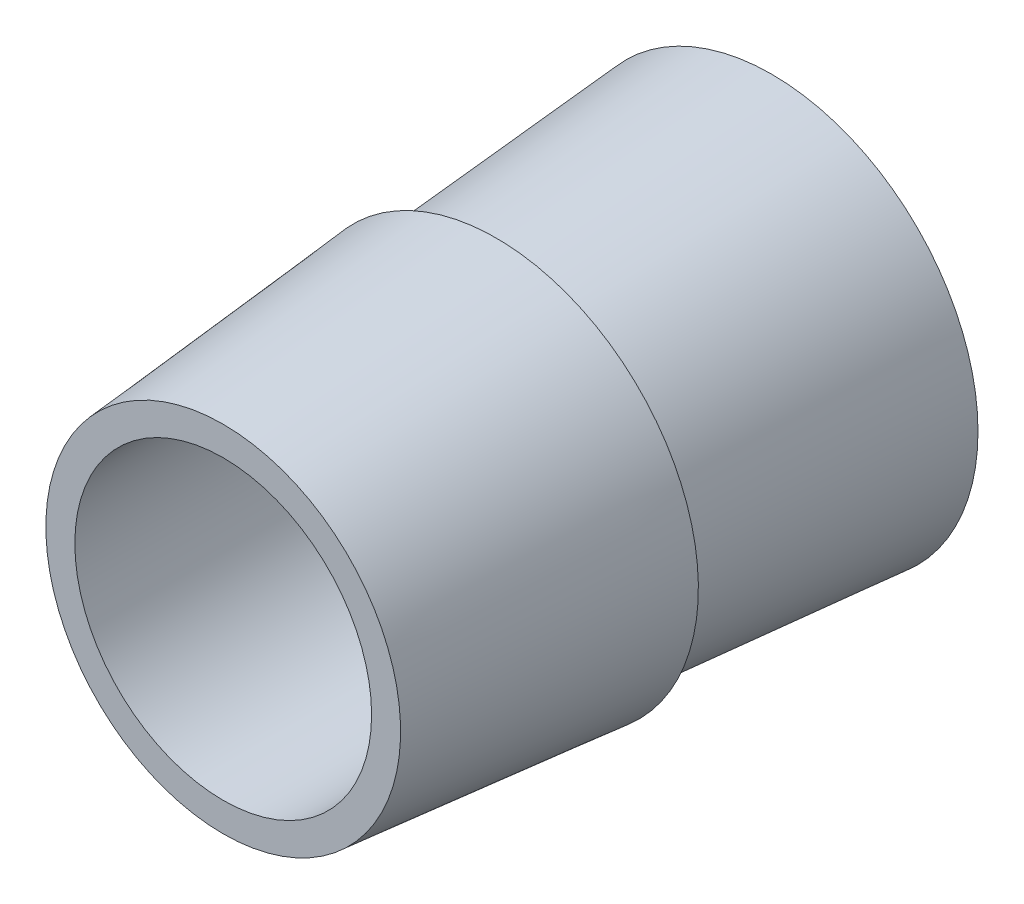
ISO-10303-21;
HEADER;
FILE_DESCRIPTION(('STEP AP214'),'2;1');
FILE_NAME('part.step','',(''),(''),'','','');
FILE_SCHEMA(('AUTOMOTIVE_DESIGN { 1 0 10303 214 1 1 1 1 }'));
ENDSEC;
DATA;
#1=APPLICATION_CONTEXT('core data for automotive mechanical design processes');
#2=APPLICATION_PROTOCOL_DEFINITION('international standard','automotive_design',2000,#1);
#3=PRODUCT_CONTEXT('',#1,'mechanical');
#4=PRODUCT('Part','Part','',(#3));
#5=PRODUCT_RELATED_PRODUCT_CATEGORY('part','',(#4));
#6=PRODUCT_DEFINITION_FORMATION('','',#4);
#7=PRODUCT_DEFINITION_CONTEXT('part definition',#1,'design');
#8=PRODUCT_DEFINITION('design','',#6,#7);
#9=PRODUCT_DEFINITION_SHAPE('','',#8);
#10=(LENGTH_UNIT() NAMED_UNIT(*) SI_UNIT(.MILLI.,.METRE.));
#11=(NAMED_UNIT(*) PLANE_ANGLE_UNIT() SI_UNIT($,.RADIAN.));
#12=(NAMED_UNIT(*) SI_UNIT($,.STERADIAN.) SOLID_ANGLE_UNIT());
#13=UNCERTAINTY_MEASURE_WITH_UNIT(LENGTH_MEASURE(1.E-05),#10,'distance_accuracy_value','');
#14=(GEOMETRIC_REPRESENTATION_CONTEXT(3) GLOBAL_UNCERTAINTY_ASSIGNED_CONTEXT((#13)) GLOBAL_UNIT_ASSIGNED_CONTEXT((#10,
#11,#12)) REPRESENTATION_CONTEXT('',''));
#15=CARTESIAN_POINT('',(0.,0.,0.));
#16=DIRECTION('',(0.,0.,1.));
#17=DIRECTION('',(1.,0.,0.));
#18=AXIS2_PLACEMENT_3D('',#15,#16,#17);
#19=CARTESIAN_POINT('',(0.,0.,0.677185358950945));
#20=DIRECTION('',(0.,0.,-1.));
#21=DIRECTION('',(0.,1.,0.));
#22=AXIS2_PLACEMENT_3D('',#19,#20,#21);
#23=PLANE('',#22);
#24=CARTESIAN_POINT('',(0.,-1.58730088404916,0.677185358950946));
#25=DIRECTION('',(0.,0.,-1.));
#26=DIRECTION('',(0.,1.,0.));
#27=AXIS2_PLACEMENT_3D('',#24,#25,#26);
#28=CIRCLE('',#27,2.5);
#29=CARTESIAN_POINT('',(0.,0.91269911595084,0.677185358950946));
#30=VERTEX_POINT('',#29);
#31=EDGE_CURVE('E68',#30,#30,#28,.T.);
#32=ORIENTED_EDGE('',*,*,#31,.T.);
#33=EDGE_LOOP('',(#32));
#34=FACE_BOUND('',#33,.T.);
#35=CARTESIAN_POINT('',(0.,-1.58730088404916,0.677185358950945));
#36=DIRECTION('',(0.,0.,1.));
#37=DIRECTION('',(0.,-1.,0.));
#38=AXIS2_PLACEMENT_3D('',#35,#36,#37);
#39=CIRCLE('',#38,2.9886299126986);
#40=CARTESIAN_POINT('',(0.,-4.57593079674776,0.677185358950945));
#41=VERTEX_POINT('',#40);
#42=EDGE_CURVE('E62',#41,#41,#39,.T.);
#43=ORIENTED_EDGE('',*,*,#42,.T.);
#44=EDGE_LOOP('',(#43));
#45=FACE_BOUND('',#44,.T.);
#46=ADVANCED_FACE('F45',(#34,#45),#23,.F.);
#47=CARTESIAN_POINT('',(0.,0.,-8.56532760744339));
#48=DIRECTION('',(0.,0.,1.));
#49=DIRECTION('',(0.,-1.,0.));
#50=AXIS2_PLACEMENT_3D('',#47,#48,#49);
#51=PLANE('',#50);
#52=CARTESIAN_POINT('',(0.,-1.58730088404916,-8.56532760744339));
#53=DIRECTION('',(0.,0.,-1.));
#54=DIRECTION('',(0.,1.,0.));
#55=AXIS2_PLACEMENT_3D('',#52,#53,#54);
#56=CIRCLE('',#55,2.5);
#57=CARTESIAN_POINT('',(0.,0.91269911595084,-8.56532760744339));
#58=VERTEX_POINT('',#57);
#59=EDGE_CURVE('E69',#58,#58,#56,.T.);
#60=ORIENTED_EDGE('',*,*,#59,.F.);
#61=EDGE_LOOP('',(#60));
#62=FACE_BOUND('',#61,.T.);
#63=CARTESIAN_POINT('',(0.,-1.58730088404916,-8.56532760744339));
#64=DIRECTION('',(0.,0.,1.));
#65=DIRECTION('',(0.,-1.,0.));
#66=AXIS2_PLACEMENT_3D('',#63,#64,#65);
#67=CIRCLE('',#66,3.47460176809833);
#68=CARTESIAN_POINT('',(0.,-5.06190265214749,-8.56532760744339));
#69=VERTEX_POINT('',#68);
#70=EDGE_CURVE('E10',#69,#69,#67,.T.);
#71=ORIENTED_EDGE('',*,*,#70,.F.);
#72=EDGE_LOOP('',(#71));
#73=FACE_BOUND('',#72,.T.);
#74=ADVANCED_FACE('F86',(#62,#73),#51,.F.);
#75=CARTESIAN_POINT('',(0.,-1.58730088404916,-8.56532760744339));
#76=DIRECTION('',(0.,0.,-1.));
#77=DIRECTION('',(0.,1.,0.));
#78=AXIS2_PLACEMENT_3D('',#75,#76,#77);
#79=CONICAL_SURFACE('',#78,3.47460176809833,0.0792126806704469);
#80=CARTESIAN_POINT('',(0.,-1.58730088404916,-3.92259589104906));
#81=DIRECTION('',(0.,0.,1.));
#82=DIRECTION('',(0.,-1.,0.));
#83=AXIS2_PLACEMENT_3D('',#80,#81,#82);
#84=CIRCLE('',#83,3.1060674126986);
#85=CARTESIAN_POINT('',(0.,-4.69336829674776,-3.92259589104906));
#86=VERTEX_POINT('',#85);
#87=EDGE_CURVE('E52',#86,#86,#84,.T.);
#88=ORIENTED_EDGE('',*,*,#87,.F.);
#89=EDGE_LOOP('',(#88));
#90=FACE_BOUND('',#89,.T.);
#91=ORIENTED_EDGE('',*,*,#70,.T.);
#92=EDGE_LOOP('',(#91));
#93=FACE_BOUND('',#92,.T.);
#94=ADVANCED_FACE('F89',(#90,#93),#79,.T.);
#95=CARTESIAN_POINT('',(0.,0.,-3.92259589104906));
#96=DIRECTION('',(0.,0.,1.));
#97=DIRECTION('',(0.,-1.,0.));
#98=AXIS2_PLACEMENT_3D('',#95,#96,#97);
#99=PLANE('',#98);
#100=CARTESIAN_POINT('',(0.,-1.58730088404916,-3.92259589104906));
#101=DIRECTION('',(0.,0.,1.));
#102=DIRECTION('',(0.,-1.,0.));
#103=AXIS2_PLACEMENT_3D('',#100,#101,#102);
#104=CIRCLE('',#103,3.4060674126986);
#105=CARTESIAN_POINT('',(0.,-4.99336829674776,-3.92259589104906));
#106=VERTEX_POINT('',#105);
#107=EDGE_CURVE('E57',#106,#106,#104,.T.);
#108=ORIENTED_EDGE('',*,*,#107,.F.);
#109=EDGE_LOOP('',(#108));
#110=FACE_BOUND('',#109,.T.);
#111=ORIENTED_EDGE('',*,*,#87,.T.);
#112=EDGE_LOOP('',(#111));
#113=FACE_BOUND('',#112,.T.);
#114=ADVANCED_FACE('F94',(#110,#113),#99,.F.);
#115=CARTESIAN_POINT('',(0.,-1.58730088404916,-3.92259589104906));
#116=DIRECTION('',(0.,0.,-1.));
#117=DIRECTION('',(0.,1.,0.));
#118=AXIS2_PLACEMENT_3D('',#115,#116,#117);
#119=CONICAL_SURFACE('',#118,3.4060674126986,0.0905036832400701);
#120=ORIENTED_EDGE('',*,*,#42,.F.);
#121=EDGE_LOOP('',(#120));
#122=FACE_BOUND('',#121,.T.);
#123=ORIENTED_EDGE('',*,*,#107,.T.);
#124=EDGE_LOOP('',(#123));
#125=FACE_BOUND('',#124,.T.);
#126=ADVANCED_FACE('F82',(#122,#125),#119,.T.);
#127=CARTESIAN_POINT('',(0.,-1.58730088404916,0.677185358950946));
#128=DIRECTION('',(0.,0.,-1.));
#129=DIRECTION('',(0.,1.,0.));
#130=AXIS2_PLACEMENT_3D('',#127,#128,#129);
#131=CYLINDRICAL_SURFACE('',#130,2.5);
#132=ORIENTED_EDGE('',*,*,#31,.F.);
#133=EDGE_LOOP('',(#132));
#134=FACE_BOUND('',#133,.T.);
#135=ORIENTED_EDGE('',*,*,#59,.T.);
#136=EDGE_LOOP('',(#135));
#137=FACE_BOUND('',#136,.T.);
#138=ADVANCED_FACE('F79',(#134,#137),#131,.F.);
#139=CLOSED_SHELL('',(#46,#74,#94,#114,#126,#138));
#140=MANIFOLD_SOLID_BREP('B2',#139);
#141=ADVANCED_BREP_SHAPE_REPRESENTATION('',(#18,#140),#14);
#142=SHAPE_DEFINITION_REPRESENTATION(#9,#141);
ENDSEC;
END-ISO-10303-21;
